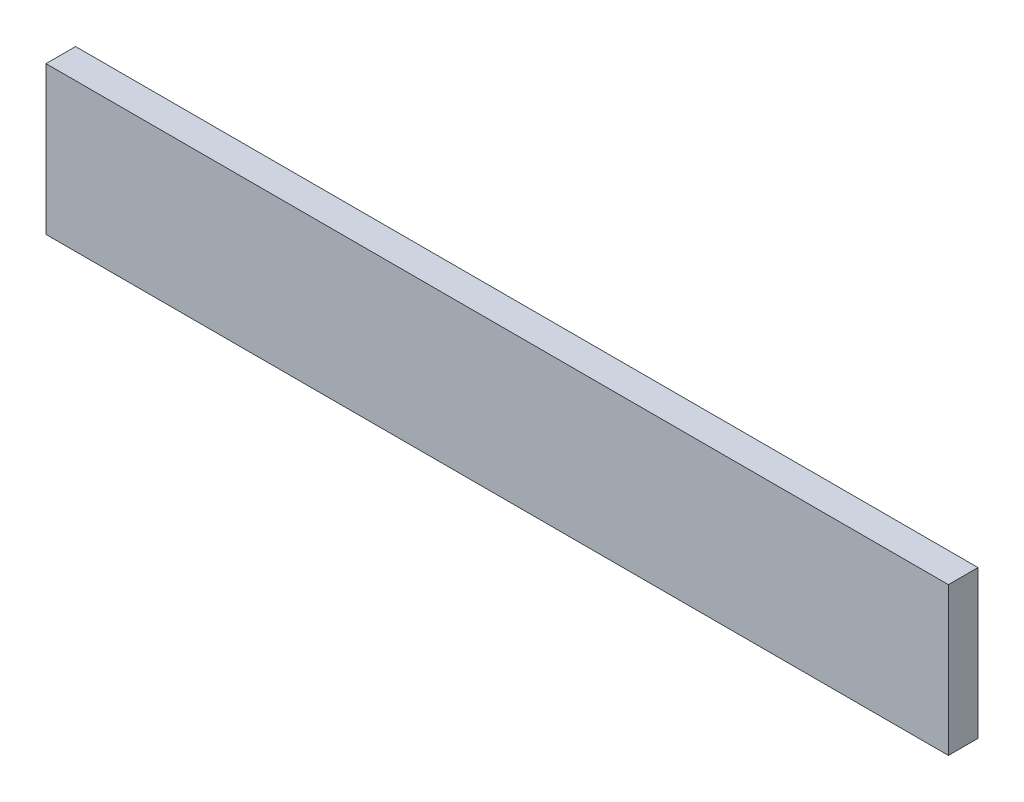
ISO-10303-21;
HEADER;
FILE_DESCRIPTION(('STEP AP214'),'2;1');
FILE_NAME('part.step','',(''),(''),'','','');
FILE_SCHEMA(('AUTOMOTIVE_DESIGN { 1 0 10303 214 1 1 1 1 }'));
ENDSEC;
DATA;
#1=APPLICATION_CONTEXT('core data for automotive mechanical design processes');
#2=APPLICATION_PROTOCOL_DEFINITION('international standard','automotive_design',2000,#1);
#3=PRODUCT_CONTEXT('',#1,'mechanical');
#4=PRODUCT('Part','Part','',(#3));
#5=PRODUCT_RELATED_PRODUCT_CATEGORY('part','',(#4));
#6=PRODUCT_DEFINITION_FORMATION('','',#4);
#7=PRODUCT_DEFINITION_CONTEXT('part definition',#1,'design');
#8=PRODUCT_DEFINITION('design','',#6,#7);
#9=PRODUCT_DEFINITION_SHAPE('','',#8);
#10=(LENGTH_UNIT() NAMED_UNIT(*) SI_UNIT(.MILLI.,.METRE.));
#11=(NAMED_UNIT(*) PLANE_ANGLE_UNIT() SI_UNIT($,.RADIAN.));
#12=(NAMED_UNIT(*) SI_UNIT($,.STERADIAN.) SOLID_ANGLE_UNIT());
#13=UNCERTAINTY_MEASURE_WITH_UNIT(LENGTH_MEASURE(1.E-05),#10,'distance_accuracy_value','');
#14=(GEOMETRIC_REPRESENTATION_CONTEXT(3) GLOBAL_UNCERTAINTY_ASSIGNED_CONTEXT((#13)) GLOBAL_UNIT_ASSIGNED_CONTEXT((#10,
#11,#12)) REPRESENTATION_CONTEXT('',''));
#15=CARTESIAN_POINT('',(0.,0.,0.));
#16=DIRECTION('',(0.,0.,1.));
#17=DIRECTION('',(1.,0.,0.));
#18=AXIS2_PLACEMENT_3D('',#15,#16,#17);
#19=CARTESIAN_POINT('',(0.,0.,-20.));
#20=DIRECTION('',(-1.,0.,0.));
#21=DIRECTION('',(0.,0.,1.));
#22=AXIS2_PLACEMENT_3D('',#19,#20,#21);
#23=PLANE('',#22);
#24=DIRECTION('',(0.,-1.,0.));
#25=VECTOR('',#24,1.);
#26=CARTESIAN_POINT('',(0.,0.,0.));
#27=LINE('',#26,#25);
#28=CARTESIAN_POINT('',(0.,100.,0.));
#29=VERTEX_POINT('',#28);
#30=CARTESIAN_POINT('',(0.,0.,0.));
#31=VERTEX_POINT('',#30);
#32=EDGE_CURVE('E102',#29,#31,#27,.T.);
#33=ORIENTED_EDGE('',*,*,#32,.F.);
#34=DIRECTION('',(0.,0.,1.));
#35=VECTOR('',#34,1.);
#36=CARTESIAN_POINT('',(0.,100.,-20.));
#37=LINE('',#36,#35);
#38=CARTESIAN_POINT('',(0.,100.,-20.));
#39=VERTEX_POINT('',#38);
#40=EDGE_CURVE('E11',#39,#29,#37,.T.);
#41=ORIENTED_EDGE('',*,*,#40,.F.);
#42=DIRECTION('',(0.,-1.,0.));
#43=VECTOR('',#42,1.);
#44=CARTESIAN_POINT('',(0.,0.,-20.));
#45=LINE('',#44,#43);
#46=CARTESIAN_POINT('',(0.,0.,-20.));
#47=VERTEX_POINT('',#46);
#48=EDGE_CURVE('E96',#39,#47,#45,.T.);
#49=ORIENTED_EDGE('',*,*,#48,.T.);
#50=DIRECTION('',(0.,0.,1.));
#51=VECTOR('',#50,1.);
#52=CARTESIAN_POINT('',(0.,0.,-20.));
#53=LINE('',#52,#51);
#54=EDGE_CURVE('E41',#47,#31,#53,.T.);
#55=ORIENTED_EDGE('',*,*,#54,.T.);
#56=EDGE_LOOP('',(#33,#41,#49,#55));
#57=FACE_BOUND('',#56,.T.);
#58=ADVANCED_FACE('F38',(#57),#23,.T.);
#59=CARTESIAN_POINT('',(0.,100.,-20.));
#60=DIRECTION('',(0.,1.,0.));
#61=DIRECTION('',(0.,0.,1.));
#62=AXIS2_PLACEMENT_3D('',#59,#60,#61);
#63=PLANE('',#62);
#64=DIRECTION('',(-1.,0.,0.));
#65=VECTOR('',#64,1.);
#66=CARTESIAN_POINT('',(0.,100.,0.));
#67=LINE('',#66,#65);
#68=CARTESIAN_POINT('',(610.,100.,0.));
#69=VERTEX_POINT('',#68);
#70=EDGE_CURVE('E98',#69,#29,#67,.T.);
#71=ORIENTED_EDGE('',*,*,#70,.F.);
#72=DIRECTION('',(0.,0.,1.));
#73=VECTOR('',#72,1.);
#74=CARTESIAN_POINT('',(610.,100.,-20.));
#75=LINE('',#74,#73);
#76=CARTESIAN_POINT('',(610.,100.,-20.));
#77=VERTEX_POINT('',#76);
#78=EDGE_CURVE('E47',#77,#69,#75,.T.);
#79=ORIENTED_EDGE('',*,*,#78,.F.);
#80=DIRECTION('',(-1.,0.,0.));
#81=VECTOR('',#80,1.);
#82=CARTESIAN_POINT('',(0.,100.,-20.));
#83=LINE('',#82,#81);
#84=EDGE_CURVE('E93',#77,#39,#83,.T.);
#85=ORIENTED_EDGE('',*,*,#84,.T.);
#86=ORIENTED_EDGE('',*,*,#40,.T.);
#87=EDGE_LOOP('',(#71,#79,#85,#86));
#88=FACE_BOUND('',#87,.T.);
#89=ADVANCED_FACE('F112',(#88),#63,.T.);
#90=CARTESIAN_POINT('',(610.,0.,-20.));
#91=DIRECTION('',(1.,0.,0.));
#92=DIRECTION('',(0.,0.,-1.));
#93=AXIS2_PLACEMENT_3D('',#90,#91,#92);
#94=PLANE('',#93);
#95=DIRECTION('',(0.,1.,0.));
#96=VECTOR('',#95,1.);
#97=CARTESIAN_POINT('',(610.,0.,0.));
#98=LINE('',#97,#96);
#99=CARTESIAN_POINT('',(610.,0.,0.));
#100=VERTEX_POINT('',#99);
#101=EDGE_CURVE('E88',#100,#69,#98,.T.);
#102=ORIENTED_EDGE('',*,*,#101,.F.);
#103=DIRECTION('',(0.,0.,1.));
#104=VECTOR('',#103,1.);
#105=CARTESIAN_POINT('',(610.,0.,-20.));
#106=LINE('',#105,#104);
#107=CARTESIAN_POINT('',(610.,0.,-20.));
#108=VERTEX_POINT('',#107);
#109=EDGE_CURVE('E83',#108,#100,#106,.T.);
#110=ORIENTED_EDGE('',*,*,#109,.F.);
#111=DIRECTION('',(0.,1.,0.));
#112=VECTOR('',#111,1.);
#113=CARTESIAN_POINT('',(610.,0.,-20.));
#114=LINE('',#113,#112);
#115=EDGE_CURVE('E86',#108,#77,#114,.T.);
#116=ORIENTED_EDGE('',*,*,#115,.T.);
#117=ORIENTED_EDGE('',*,*,#78,.T.);
#118=EDGE_LOOP('',(#102,#110,#116,#117));
#119=FACE_BOUND('',#118,.T.);
#120=ADVANCED_FACE('F85',(#119),#94,.T.);
#121=CARTESIAN_POINT('',(0.,0.,-20.));
#122=DIRECTION('',(0.,-1.,0.));
#123=DIRECTION('',(0.,0.,-1.));
#124=AXIS2_PLACEMENT_3D('',#121,#122,#123);
#125=PLANE('',#124);
#126=DIRECTION('',(1.,0.,0.));
#127=VECTOR('',#126,1.);
#128=CARTESIAN_POINT('',(0.,0.,0.));
#129=LINE('',#128,#127);
#130=EDGE_CURVE('E105',#31,#100,#129,.T.);
#131=ORIENTED_EDGE('',*,*,#130,.F.);
#132=ORIENTED_EDGE('',*,*,#54,.F.);
#133=DIRECTION('',(1.,0.,0.));
#134=VECTOR('',#133,1.);
#135=CARTESIAN_POINT('',(0.,0.,-20.));
#136=LINE('',#135,#134);
#137=EDGE_CURVE('E92',#47,#108,#136,.T.);
#138=ORIENTED_EDGE('',*,*,#137,.T.);
#139=ORIENTED_EDGE('',*,*,#109,.T.);
#140=EDGE_LOOP('',(#131,#132,#138,#139));
#141=FACE_BOUND('',#140,.T.);
#142=ADVANCED_FACE('F95',(#141),#125,.T.);
#143=CARTESIAN_POINT('',(0.,0.,-20.));
#144=DIRECTION('',(0.,0.,-1.));
#145=DIRECTION('',(-1.,0.,0.));
#146=AXIS2_PLACEMENT_3D('',#143,#144,#145);
#147=PLANE('',#146);
#148=ORIENTED_EDGE('',*,*,#48,.F.);
#149=ORIENTED_EDGE('',*,*,#84,.F.);
#150=ORIENTED_EDGE('',*,*,#115,.F.);
#151=ORIENTED_EDGE('',*,*,#137,.F.);
#152=EDGE_LOOP('',(#148,#149,#150,#151));
#153=FACE_BOUND('',#152,.T.);
#154=ADVANCED_FACE('F91',(#153),#147,.T.);
#155=CARTESIAN_POINT('',(0.,0.,0.));
#156=DIRECTION('',(0.,0.,-1.));
#157=DIRECTION('',(-1.,0.,0.));
#158=AXIS2_PLACEMENT_3D('',#155,#156,#157);
#159=PLANE('',#158);
#160=ORIENTED_EDGE('',*,*,#32,.T.);
#161=ORIENTED_EDGE('',*,*,#130,.T.);
#162=ORIENTED_EDGE('',*,*,#101,.T.);
#163=ORIENTED_EDGE('',*,*,#70,.T.);
#164=EDGE_LOOP('',(#160,#161,#162,#163));
#165=FACE_BOUND('',#164,.T.);
#166=ADVANCED_FACE('F111',(#165),#159,.F.);
#167=CLOSED_SHELL('',(#58,#89,#120,#142,#154,#166));
#168=MANIFOLD_SOLID_BREP('B2',#167);
#169=ADVANCED_BREP_SHAPE_REPRESENTATION('',(#18,#168),#14);
#170=SHAPE_DEFINITION_REPRESENTATION(#9,#169);
ENDSEC;
END-ISO-10303-21;
